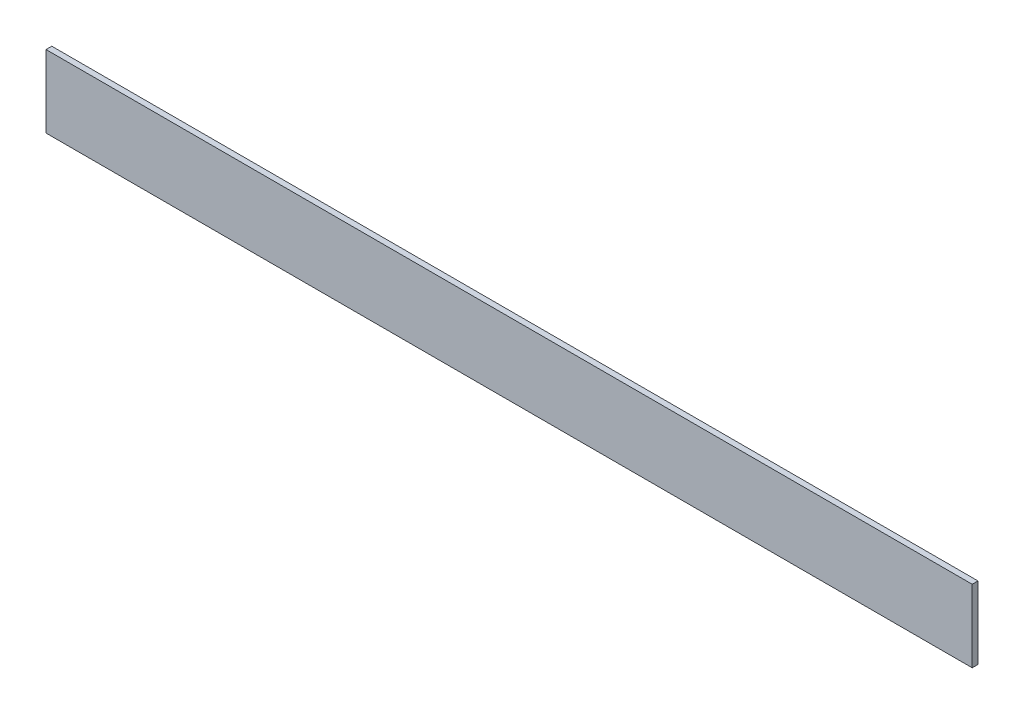
ISO-10303-21;
HEADER;
FILE_DESCRIPTION(('STEP AP214'),'2;1');
FILE_NAME('part.step','',(''),(''),'','','');
FILE_SCHEMA(('AUTOMOTIVE_DESIGN { 1 0 10303 214 1 1 1 1 }'));
ENDSEC;
DATA;
#1=APPLICATION_CONTEXT('core data for automotive mechanical design processes');
#2=APPLICATION_PROTOCOL_DEFINITION('international standard','automotive_design',2000,#1);
#3=PRODUCT_CONTEXT('',#1,'mechanical');
#4=PRODUCT('Part','Part','',(#3));
#5=PRODUCT_RELATED_PRODUCT_CATEGORY('part','',(#4));
#6=PRODUCT_DEFINITION_FORMATION('','',#4);
#7=PRODUCT_DEFINITION_CONTEXT('part definition',#1,'design');
#8=PRODUCT_DEFINITION('design','',#6,#7);
#9=PRODUCT_DEFINITION_SHAPE('','',#8);
#10=(LENGTH_UNIT() NAMED_UNIT(*) SI_UNIT(.MILLI.,.METRE.));
#11=(NAMED_UNIT(*) PLANE_ANGLE_UNIT() SI_UNIT($,.RADIAN.));
#12=(NAMED_UNIT(*) SI_UNIT($,.STERADIAN.) SOLID_ANGLE_UNIT());
#13=UNCERTAINTY_MEASURE_WITH_UNIT(LENGTH_MEASURE(1.E-05),#10,'distance_accuracy_value','');
#14=(GEOMETRIC_REPRESENTATION_CONTEXT(3) GLOBAL_UNCERTAINTY_ASSIGNED_CONTEXT((#13)) GLOBAL_UNIT_ASSIGNED_CONTEXT((#10,
#11,#12)) REPRESENTATION_CONTEXT('',''));
#15=CARTESIAN_POINT('',(0.,0.,0.));
#16=DIRECTION('',(0.,0.,1.));
#17=DIRECTION('',(1.,0.,0.));
#18=AXIS2_PLACEMENT_3D('',#15,#16,#17);
#19=CARTESIAN_POINT('',(320.,0.,0.));
#20=DIRECTION('',(0.,1.,0.));
#21=DIRECTION('',(0.,0.,1.));
#22=AXIS2_PLACEMENT_3D('',#19,#20,#21);
#23=PLANE('',#22);
#24=DIRECTION('',(-1.,0.,0.));
#25=VECTOR('',#24,1.);
#26=CARTESIAN_POINT('',(320.,0.,-25.));
#27=LINE('',#26,#25);
#28=CARTESIAN_POINT('',(297.,0.,-25.));
#29=VERTEX_POINT('',#28);
#30=CARTESIAN_POINT('',(0.,0.,-25.));
#31=VERTEX_POINT('',#30);
#32=EDGE_CURVE('E11',#29,#31,#27,.T.);
#33=ORIENTED_EDGE('',*,*,#32,.F.);
#34=DIRECTION('',(0.,0.,-1.));
#35=VECTOR('',#34,1.);
#36=CARTESIAN_POINT('',(297.,0.,-25.));
#37=LINE('',#36,#35);
#38=CARTESIAN_POINT('',(297.,0.,-2.));
#39=VERTEX_POINT('',#38);
#40=EDGE_CURVE('E99',#39,#29,#37,.T.);
#41=ORIENTED_EDGE('',*,*,#40,.F.);
#42=DIRECTION('',(-1.,0.,0.));
#43=VECTOR('',#42,1.);
#44=CARTESIAN_POINT('',(297.,0.,-2.));
#45=LINE('',#44,#43);
#46=CARTESIAN_POINT('',(320.,0.,-2.));
#47=VERTEX_POINT('',#46);
#48=EDGE_CURVE('E110',#47,#39,#45,.T.);
#49=ORIENTED_EDGE('',*,*,#48,.F.);
#50=DIRECTION('',(0.,0.,-1.));
#51=VECTOR('',#50,1.);
#52=CARTESIAN_POINT('',(320.,0.,0.));
#53=LINE('',#52,#51);
#54=CARTESIAN_POINT('',(320.,0.,0.));
#55=VERTEX_POINT('',#54);
#56=EDGE_CURVE('E142',#55,#47,#53,.T.);
#57=ORIENTED_EDGE('',*,*,#56,.F.);
#58=DIRECTION('',(-1.,0.,0.));
#59=VECTOR('',#58,1.);
#60=CARTESIAN_POINT('',(320.,0.,0.));
#61=LINE('',#60,#59);
#62=CARTESIAN_POINT('',(0.,0.,0.));
#63=VERTEX_POINT('',#62);
#64=EDGE_CURVE('E122',#55,#63,#61,.T.);
#65=ORIENTED_EDGE('',*,*,#64,.T.);
#66=DIRECTION('',(0.,0.,-1.));
#67=VECTOR('',#66,1.);
#68=CARTESIAN_POINT('',(0.,0.,0.));
#69=LINE('',#68,#67);
#70=EDGE_CURVE('E119',#63,#31,#69,.T.);
#71=ORIENTED_EDGE('',*,*,#70,.T.);
#72=EDGE_LOOP('',(#33,#41,#49,#57,#65,#71));
#73=FACE_BOUND('',#72,.T.);
#74=ADVANCED_FACE('F36',(#73),#23,.F.);
#75=CARTESIAN_POINT('',(320.,2.,-25.));
#76=DIRECTION('',(0.,0.,-1.));
#77=DIRECTION('',(-1.,0.,0.));
#78=AXIS2_PLACEMENT_3D('',#75,#76,#77);
#79=PLANE('',#78);
#80=DIRECTION('',(0.,-1.,0.));
#81=VECTOR('',#80,1.);
#82=CARTESIAN_POINT('',(297.,25.,-25.));
#83=LINE('',#82,#81);
#84=CARTESIAN_POINT('',(297.,2.,-25.));
#85=VERTEX_POINT('',#84);
#86=EDGE_CURVE('E102',#85,#29,#83,.T.);
#87=ORIENTED_EDGE('',*,*,#86,.T.);
#88=ORIENTED_EDGE('',*,*,#32,.T.);
#89=DIRECTION('',(0.,-1.,0.));
#90=VECTOR('',#89,1.);
#91=CARTESIAN_POINT('',(0.,2.,-25.));
#92=LINE('',#91,#90);
#93=CARTESIAN_POINT('',(0.,2.,-25.));
#94=VERTEX_POINT('',#93);
#95=EDGE_CURVE('E124',#94,#31,#92,.T.);
#96=ORIENTED_EDGE('',*,*,#95,.F.);
#97=DIRECTION('',(-1.,0.,0.));
#98=VECTOR('',#97,1.);
#99=CARTESIAN_POINT('',(320.,2.,-25.));
#100=LINE('',#99,#98);
#101=EDGE_CURVE('E44',#85,#94,#100,.T.);
#102=ORIENTED_EDGE('',*,*,#101,.F.);
#103=EDGE_LOOP('',(#87,#88,#96,#102));
#104=FACE_BOUND('',#103,.T.);
#105=ADVANCED_FACE('F114',(#104),#79,.T.);
#106=CARTESIAN_POINT('',(320.,2.,0.));
#107=DIRECTION('',(0.,1.,0.));
#108=DIRECTION('',(0.,0.,1.));
#109=AXIS2_PLACEMENT_3D('',#106,#107,#108);
#110=PLANE('',#109);
#111=DIRECTION('',(0.,0.,1.));
#112=VECTOR('',#111,1.);
#113=CARTESIAN_POINT('',(297.,2.,0.));
#114=LINE('',#113,#112);
#115=CARTESIAN_POINT('',(297.,2.,-2.));
#116=VERTEX_POINT('',#115);
#117=EDGE_CURVE('E125',#85,#116,#114,.T.);
#118=ORIENTED_EDGE('',*,*,#117,.F.);
#119=ORIENTED_EDGE('',*,*,#101,.T.);
#120=DIRECTION('',(0.,0.,-1.));
#121=VECTOR('',#120,1.);
#122=CARTESIAN_POINT('',(0.,2.,0.));
#123=LINE('',#122,#121);
#124=CARTESIAN_POINT('',(0.,2.,-2.));
#125=VERTEX_POINT('',#124);
#126=EDGE_CURVE('E131',#125,#94,#123,.T.);
#127=ORIENTED_EDGE('',*,*,#126,.F.);
#128=DIRECTION('',(-1.,0.,0.));
#129=VECTOR('',#128,1.);
#130=CARTESIAN_POINT('',(320.,2.,-2.));
#131=LINE('',#130,#129);
#132=EDGE_CURVE('E146',#116,#125,#131,.T.);
#133=ORIENTED_EDGE('',*,*,#132,.F.);
#134=EDGE_LOOP('',(#118,#119,#127,#133));
#135=FACE_BOUND('',#134,.T.);
#136=ADVANCED_FACE('F148',(#135),#110,.T.);
#137=CARTESIAN_POINT('',(320.,25.,-2.));
#138=DIRECTION('',(0.,0.,-1.));
#139=DIRECTION('',(0.,1.,0.));
#140=AXIS2_PLACEMENT_3D('',#137,#138,#139);
#141=PLANE('',#140);
#142=DIRECTION('',(0.,-1.,0.));
#143=VECTOR('',#142,1.);
#144=CARTESIAN_POINT('',(0.,25.,-2.));
#145=LINE('',#144,#143);
#146=CARTESIAN_POINT('',(0.,25.,-2.));
#147=VERTEX_POINT('',#146);
#148=EDGE_CURVE('E133',#147,#125,#145,.T.);
#149=ORIENTED_EDGE('',*,*,#148,.F.);
#150=DIRECTION('',(-1.,0.,0.));
#151=VECTOR('',#150,1.);
#152=CARTESIAN_POINT('',(320.,25.,-2.));
#153=LINE('',#152,#151);
#154=CARTESIAN_POINT('',(320.,25.,-2.));
#155=VERTEX_POINT('',#154);
#156=EDGE_CURVE('E82',#155,#147,#153,.T.);
#157=ORIENTED_EDGE('',*,*,#156,.F.);
#158=DIRECTION('',(0.,-1.,0.));
#159=VECTOR('',#158,1.);
#160=CARTESIAN_POINT('',(320.,25.,-2.));
#161=LINE('',#160,#159);
#162=EDGE_CURVE('E154',#155,#47,#161,.T.);
#163=ORIENTED_EDGE('',*,*,#162,.T.);
#164=ORIENTED_EDGE('',*,*,#48,.T.);
#165=DIRECTION('',(0.,-1.,0.));
#166=VECTOR('',#165,1.);
#167=CARTESIAN_POINT('',(297.,25.,-2.));
#168=LINE('',#167,#166);
#169=EDGE_CURVE('E105',#116,#39,#168,.T.);
#170=ORIENTED_EDGE('',*,*,#169,.F.);
#171=ORIENTED_EDGE('',*,*,#132,.T.);
#172=EDGE_LOOP('',(#149,#157,#163,#164,#170,#171));
#173=FACE_BOUND('',#172,.T.);
#174=ADVANCED_FACE('F162',(#173),#141,.T.);
#175=CARTESIAN_POINT('',(320.,25.,0.));
#176=DIRECTION('',(0.,1.,0.));
#177=DIRECTION('',(0.,0.,1.));
#178=AXIS2_PLACEMENT_3D('',#175,#176,#177);
#179=PLANE('',#178);
#180=DIRECTION('',(0.,0.,-1.));
#181=VECTOR('',#180,1.);
#182=CARTESIAN_POINT('',(0.,25.,0.));
#183=LINE('',#182,#181);
#184=CARTESIAN_POINT('',(0.,25.,0.));
#185=VERTEX_POINT('',#184);
#186=EDGE_CURVE('E138',#185,#147,#183,.T.);
#187=ORIENTED_EDGE('',*,*,#186,.F.);
#188=DIRECTION('',(-1.,0.,0.));
#189=VECTOR('',#188,1.);
#190=CARTESIAN_POINT('',(320.,25.,0.));
#191=LINE('',#190,#189);
#192=CARTESIAN_POINT('',(320.,25.,0.));
#193=VERTEX_POINT('',#192);
#194=EDGE_CURVE('E74',#193,#185,#191,.T.);
#195=ORIENTED_EDGE('',*,*,#194,.F.);
#196=DIRECTION('',(0.,0.,-1.));
#197=VECTOR('',#196,1.);
#198=CARTESIAN_POINT('',(320.,25.,0.));
#199=LINE('',#198,#197);
#200=EDGE_CURVE('E156',#193,#155,#199,.T.);
#201=ORIENTED_EDGE('',*,*,#200,.T.);
#202=ORIENTED_EDGE('',*,*,#156,.T.);
#203=EDGE_LOOP('',(#187,#195,#201,#202));
#204=FACE_BOUND('',#203,.T.);
#205=ADVANCED_FACE('F160',(#204),#179,.T.);
#206=CARTESIAN_POINT('',(320.,25.,0.));
#207=DIRECTION('',(0.,0.,-1.));
#208=DIRECTION('',(0.,1.,0.));
#209=AXIS2_PLACEMENT_3D('',#206,#207,#208);
#210=PLANE('',#209);
#211=DIRECTION('',(0.,-1.,0.));
#212=VECTOR('',#211,1.);
#213=CARTESIAN_POINT('',(0.,25.,0.));
#214=LINE('',#213,#212);
#215=EDGE_CURVE('E76',#185,#63,#214,.T.);
#216=ORIENTED_EDGE('',*,*,#215,.T.);
#217=ORIENTED_EDGE('',*,*,#64,.F.);
#218=DIRECTION('',(0.,-1.,0.));
#219=VECTOR('',#218,1.);
#220=CARTESIAN_POINT('',(320.,25.,0.));
#221=LINE('',#220,#219);
#222=EDGE_CURVE('E52',#193,#55,#221,.T.);
#223=ORIENTED_EDGE('',*,*,#222,.F.);
#224=ORIENTED_EDGE('',*,*,#194,.T.);
#225=EDGE_LOOP('',(#216,#217,#223,#224));
#226=FACE_BOUND('',#225,.T.);
#227=ADVANCED_FACE('F170',(#226),#210,.F.);
#228=CARTESIAN_POINT('',(320.,0.,0.));
#229=DIRECTION('',(-1.,0.,0.));
#230=DIRECTION('',(0.,0.,1.));
#231=AXIS2_PLACEMENT_3D('',#228,#229,#230);
#232=PLANE('',#231);
#233=ORIENTED_EDGE('',*,*,#56,.T.);
#234=ORIENTED_EDGE('',*,*,#162,.F.);
#235=ORIENTED_EDGE('',*,*,#200,.F.);
#236=ORIENTED_EDGE('',*,*,#222,.T.);
#237=EDGE_LOOP('',(#233,#234,#235,#236));
#238=FACE_BOUND('',#237,.T.);
#239=ADVANCED_FACE('F161',(#238),#232,.F.);
#240=CARTESIAN_POINT('',(0.,0.,0.));
#241=DIRECTION('',(-1.,0.,0.));
#242=DIRECTION('',(0.,0.,1.));
#243=AXIS2_PLACEMENT_3D('',#240,#241,#242);
#244=PLANE('',#243);
#245=ORIENTED_EDGE('',*,*,#70,.F.);
#246=ORIENTED_EDGE('',*,*,#215,.F.);
#247=ORIENTED_EDGE('',*,*,#186,.T.);
#248=ORIENTED_EDGE('',*,*,#148,.T.);
#249=ORIENTED_EDGE('',*,*,#126,.T.);
#250=ORIENTED_EDGE('',*,*,#95,.T.);
#251=EDGE_LOOP('',(#245,#246,#247,#248,#249,#250));
#252=FACE_BOUND('',#251,.T.);
#253=ADVANCED_FACE('F128',(#252),#244,.T.);
#254=CARTESIAN_POINT('',(297.,25.,-25.));
#255=DIRECTION('',(-1.,0.,0.));
#256=DIRECTION('',(0.,0.,1.));
#257=AXIS2_PLACEMENT_3D('',#254,#255,#256);
#258=PLANE('',#257);
#259=ORIENTED_EDGE('',*,*,#117,.T.);
#260=ORIENTED_EDGE('',*,*,#169,.T.);
#261=ORIENTED_EDGE('',*,*,#40,.T.);
#262=ORIENTED_EDGE('',*,*,#86,.F.);
#263=EDGE_LOOP('',(#259,#260,#261,#262));
#264=FACE_BOUND('',#263,.T.);
#265=ADVANCED_FACE('F101',(#264),#258,.F.);
#266=CLOSED_SHELL('',(#74,#105,#136,#174,#205,#227,#239,#253,#265));
#267=MANIFOLD_SOLID_BREP('B2',#266);
#268=ADVANCED_BREP_SHAPE_REPRESENTATION('',(#18,#267),#14);
#269=SHAPE_DEFINITION_REPRESENTATION(#9,#268);
ENDSEC;
END-ISO-10303-21;
